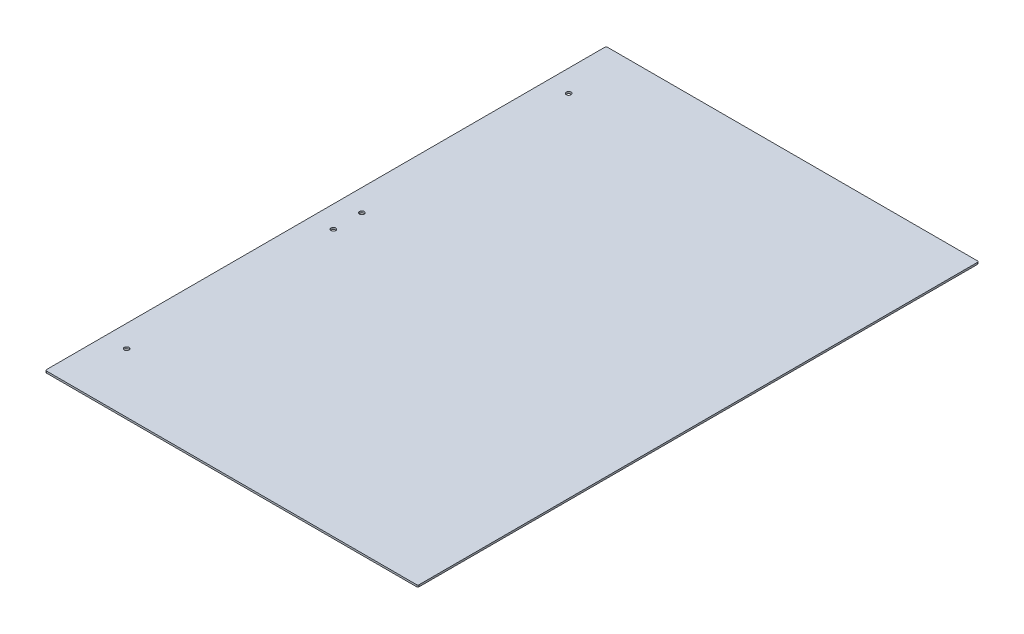
ISO-10303-21;
HEADER;
FILE_DESCRIPTION(('STEP AP214'),'2;1');
FILE_NAME('part.step','',(''),(''),'','','');
FILE_SCHEMA(('AUTOMOTIVE_DESIGN { 1 0 10303 214 1 1 1 1 }'));
ENDSEC;
DATA;
#1=APPLICATION_CONTEXT('core data for automotive mechanical design processes');
#2=APPLICATION_PROTOCOL_DEFINITION('international standard','automotive_design',2000,#1);
#3=PRODUCT_CONTEXT('',#1,'mechanical');
#4=PRODUCT('Part','Part','',(#3));
#5=PRODUCT_RELATED_PRODUCT_CATEGORY('part','',(#4));
#6=PRODUCT_DEFINITION_FORMATION('','',#4);
#7=PRODUCT_DEFINITION_CONTEXT('part definition',#1,'design');
#8=PRODUCT_DEFINITION('design','',#6,#7);
#9=PRODUCT_DEFINITION_SHAPE('','',#8);
#10=(LENGTH_UNIT() NAMED_UNIT(*) SI_UNIT(.MILLI.,.METRE.));
#11=(NAMED_UNIT(*) PLANE_ANGLE_UNIT() SI_UNIT($,.RADIAN.));
#12=(NAMED_UNIT(*) SI_UNIT($,.STERADIAN.) SOLID_ANGLE_UNIT());
#13=UNCERTAINTY_MEASURE_WITH_UNIT(LENGTH_MEASURE(1.E-05),#10,'distance_accuracy_value','');
#14=(GEOMETRIC_REPRESENTATION_CONTEXT(3) GLOBAL_UNCERTAINTY_ASSIGNED_CONTEXT((#13)) GLOBAL_UNIT_ASSIGNED_CONTEXT((#10,
#11,#12)) REPRESENTATION_CONTEXT('',''));
#15=CARTESIAN_POINT('',(0.,0.,0.));
#16=DIRECTION('',(0.,0.,1.));
#17=DIRECTION('',(1.,0.,0.));
#18=AXIS2_PLACEMENT_3D('',#15,#16,#17);
#19=CARTESIAN_POINT('',(0.,3.,0.));
#20=DIRECTION('',(0.,-1.,0.));
#21=DIRECTION('',(0.,0.,-1.));
#22=AXIS2_PLACEMENT_3D('',#19,#20,#21);
#23=PLANE('',#22);
#24=CARTESIAN_POINT('',(-266.065,3.,-23.0886));
#25=DIRECTION('',(0.,1.,0.));
#26=DIRECTION('',(0.,0.,1.));
#27=AXIS2_PLACEMENT_3D('',#24,#25,#26);
#28=CIRCLE('',#27,3.80999999999999);
#29=CARTESIAN_POINT('',(-266.065,3.,-19.2786));
#30=VERTEX_POINT('',#29);
#31=EDGE_CURVE('E143',#30,#30,#28,.F.);
#32=ORIENTED_EDGE('',*,*,#31,.T.);
#33=EDGE_LOOP('',(#32));
#34=FACE_BOUND('',#33,.T.);
#35=CARTESIAN_POINT('',(-299.593,3.,-451.993));
#36=DIRECTION('',(0.,-1.,0.));
#37=DIRECTION('',(0.,0.,-1.));
#38=AXIS2_PLACEMENT_3D('',#35,#36,#37);
#39=CIRCLE('',#38,2.03199999999998);
#40=CARTESIAN_POINT('',(-301.625,3.,-451.993));
#41=VERTEX_POINT('',#40);
#42=CARTESIAN_POINT('',(-299.593,3.,-454.025));
#43=VERTEX_POINT('',#42);
#44=EDGE_CURVE('E80',#41,#43,#39,.T.);
#45=ORIENTED_EDGE('',*,*,#44,.F.);
#46=DIRECTION('',(0.,0.,-1.));
#47=VECTOR('',#46,1.);
#48=CARTESIAN_POINT('',(-301.625,3.,454.025));
#49=LINE('',#48,#47);
#50=CARTESIAN_POINT('',(-301.625,3.,451.993));
#51=VERTEX_POINT('',#50);
#52=EDGE_CURVE('E98',#41,#51,#49,.F.);
#53=ORIENTED_EDGE('',*,*,#52,.T.);
#54=CARTESIAN_POINT('',(-299.593,3.,451.993));
#55=DIRECTION('',(0.,-1.,0.));
#56=DIRECTION('',(0.,0.,-1.));
#57=AXIS2_PLACEMENT_3D('',#54,#55,#56);
#58=CIRCLE('',#57,2.03199999999998);
#59=CARTESIAN_POINT('',(-299.593,3.,454.025));
#60=VERTEX_POINT('',#59);
#61=EDGE_CURVE('E114',#60,#51,#58,.T.);
#62=ORIENTED_EDGE('',*,*,#61,.F.);
#63=DIRECTION('',(-1.,0.,0.));
#64=VECTOR('',#63,1.);
#65=CARTESIAN_POINT('',(-301.625,3.,454.025));
#66=LINE('',#65,#64);
#67=CARTESIAN_POINT('',(299.593,3.,454.025));
#68=VERTEX_POINT('',#67);
#69=EDGE_CURVE('E111',#60,#68,#66,.F.);
#70=ORIENTED_EDGE('',*,*,#69,.T.);
#71=CARTESIAN_POINT('',(299.593,3.,451.993));
#72=DIRECTION('',(0.,-1.,0.));
#73=DIRECTION('',(0.,0.,-1.));
#74=AXIS2_PLACEMENT_3D('',#71,#72,#73);
#75=CIRCLE('',#74,2.03199999999998);
#76=CARTESIAN_POINT('',(301.625,3.,451.993));
#77=VERTEX_POINT('',#76);
#78=EDGE_CURVE('E149',#77,#68,#75,.T.);
#79=ORIENTED_EDGE('',*,*,#78,.F.);
#80=DIRECTION('',(0.,0.,1.));
#81=VECTOR('',#80,1.);
#82=CARTESIAN_POINT('',(301.625,3.,454.025));
#83=LINE('',#82,#81);
#84=CARTESIAN_POINT('',(301.625,3.,-451.993));
#85=VERTEX_POINT('',#84);
#86=EDGE_CURVE('E118',#77,#85,#83,.F.);
#87=ORIENTED_EDGE('',*,*,#86,.T.);
#88=CARTESIAN_POINT('',(299.593,3.,-451.993));
#89=DIRECTION('',(0.,-1.,0.));
#90=DIRECTION('',(0.,0.,-1.));
#91=AXIS2_PLACEMENT_3D('',#88,#89,#90);
#92=CIRCLE('',#91,2.03199999999998);
#93=CARTESIAN_POINT('',(299.593,3.,-454.025));
#94=VERTEX_POINT('',#93);
#95=EDGE_CURVE('E86',#94,#85,#92,.T.);
#96=ORIENTED_EDGE('',*,*,#95,.F.);
#97=DIRECTION('',(1.,0.,0.));
#98=VECTOR('',#97,1.);
#99=CARTESIAN_POINT('',(-301.625,3.,-454.025));
#100=LINE('',#99,#98);
#101=EDGE_CURVE('E83',#94,#43,#100,.F.);
#102=ORIENTED_EDGE('',*,*,#101,.T.);
#103=EDGE_LOOP('',(#45,#53,#62,#70,#79,#87,#96,#102));
#104=FACE_BOUND('',#103,.T.);
#105=CARTESIAN_POINT('',(-266.065,3.,-357.9114));
#106=DIRECTION('',(0.,1.,0.));
#107=DIRECTION('',(0.,0.,1.));
#108=AXIS2_PLACEMENT_3D('',#105,#106,#107);
#109=CIRCLE('',#108,3.80999999999998);
#110=CARTESIAN_POINT('',(-266.065,3.,-354.1014));
#111=VERTEX_POINT('',#110);
#112=EDGE_CURVE('E117',#111,#111,#109,.F.);
#113=ORIENTED_EDGE('',*,*,#112,.T.);
#114=EDGE_LOOP('',(#113));
#115=FACE_BOUND('',#114,.T.);
#116=CARTESIAN_POINT('',(-266.065,3.,23.0886));
#117=DIRECTION('',(0.,1.,0.));
#118=DIRECTION('',(0.,0.,1.));
#119=AXIS2_PLACEMENT_3D('',#116,#117,#118);
#120=CIRCLE('',#119,3.80999999999999);
#121=CARTESIAN_POINT('',(-266.065,3.,26.8986));
#122=VERTEX_POINT('',#121);
#123=EDGE_CURVE('E153',#122,#122,#120,.F.);
#124=ORIENTED_EDGE('',*,*,#123,.T.);
#125=EDGE_LOOP('',(#124));
#126=FACE_BOUND('',#125,.T.);
#127=CARTESIAN_POINT('',(-266.065,3.,357.9114));
#128=DIRECTION('',(0.,1.,0.));
#129=DIRECTION('',(0.,0.,1.));
#130=AXIS2_PLACEMENT_3D('',#127,#128,#129);
#131=CIRCLE('',#130,3.80999999999998);
#132=CARTESIAN_POINT('',(-266.065,3.,361.7214));
#133=VERTEX_POINT('',#132);
#134=EDGE_CURVE('E20',#133,#133,#131,.F.);
#135=ORIENTED_EDGE('',*,*,#134,.T.);
#136=EDGE_LOOP('',(#135));
#137=FACE_BOUND('',#136,.T.);
#138=ADVANCED_FACE('F17',(#34,#104,#115,#126,#137),#23,.F.);
#139=CARTESIAN_POINT('',(-266.065,0.,357.9114));
#140=DIRECTION('',(0.,1.,0.));
#141=DIRECTION('',(0.,0.,1.));
#142=AXIS2_PLACEMENT_3D('',#139,#140,#141);
#143=CYLINDRICAL_SURFACE('',#142,3.80999999999998);
#144=CARTESIAN_POINT('',(-266.065,0.,357.9114));
#145=DIRECTION('',(0.,1.,0.));
#146=DIRECTION('',(0.,0.,1.));
#147=AXIS2_PLACEMENT_3D('',#144,#145,#146);
#148=CIRCLE('',#147,3.80999999999998);
#149=CARTESIAN_POINT('',(-266.065,0.,361.7214));
#150=VERTEX_POINT('',#149);
#151=EDGE_CURVE('E140',#150,#150,#148,.T.);
#152=ORIENTED_EDGE('',*,*,#151,.F.);
#153=EDGE_LOOP('',(#152));
#154=FACE_BOUND('',#153,.T.);
#155=ORIENTED_EDGE('',*,*,#134,.F.);
#156=EDGE_LOOP('',(#155));
#157=FACE_BOUND('',#156,.T.);
#158=ADVANCED_FACE('F161',(#154,#157),#143,.F.);
#159=CARTESIAN_POINT('',(-266.065,0.,23.0886));
#160=DIRECTION('',(0.,1.,0.));
#161=DIRECTION('',(0.,0.,1.));
#162=AXIS2_PLACEMENT_3D('',#159,#160,#161);
#163=CYLINDRICAL_SURFACE('',#162,3.80999999999999);
#164=ORIENTED_EDGE('',*,*,#123,.F.);
#165=EDGE_LOOP('',(#164));
#166=FACE_BOUND('',#165,.T.);
#167=CARTESIAN_POINT('',(-266.065,0.,23.0886));
#168=DIRECTION('',(0.,1.,0.));
#169=DIRECTION('',(0.,0.,1.));
#170=AXIS2_PLACEMENT_3D('',#167,#168,#169);
#171=CIRCLE('',#170,3.80999999999999);
#172=CARTESIAN_POINT('',(-266.065,0.,26.8986));
#173=VERTEX_POINT('',#172);
#174=EDGE_CURVE('E137',#173,#173,#171,.T.);
#175=ORIENTED_EDGE('',*,*,#174,.F.);
#176=EDGE_LOOP('',(#175));
#177=FACE_BOUND('',#176,.T.);
#178=ADVANCED_FACE('F163',(#166,#177),#163,.F.);
#179=CARTESIAN_POINT('',(-266.065,0.,-357.9114));
#180=DIRECTION('',(0.,1.,0.));
#181=DIRECTION('',(0.,0.,1.));
#182=AXIS2_PLACEMENT_3D('',#179,#180,#181);
#183=CYLINDRICAL_SURFACE('',#182,3.80999999999998);
#184=ORIENTED_EDGE('',*,*,#112,.F.);
#185=EDGE_LOOP('',(#184));
#186=FACE_BOUND('',#185,.T.);
#187=CARTESIAN_POINT('',(-266.065,0.,-357.9114));
#188=DIRECTION('',(0.,1.,0.));
#189=DIRECTION('',(0.,0.,1.));
#190=AXIS2_PLACEMENT_3D('',#187,#188,#189);
#191=CIRCLE('',#190,3.80999999999998);
#192=CARTESIAN_POINT('',(-266.065,0.,-354.1014));
#193=VERTEX_POINT('',#192);
#194=EDGE_CURVE('E134',#193,#193,#191,.T.);
#195=ORIENTED_EDGE('',*,*,#194,.F.);
#196=EDGE_LOOP('',(#195));
#197=FACE_BOUND('',#196,.T.);
#198=ADVANCED_FACE('F170',(#186,#197),#183,.F.);
#199=CARTESIAN_POINT('',(-301.625,3.,454.025));
#200=DIRECTION('',(1.,0.,0.));
#201=DIRECTION('',(0.,0.,-1.));
#202=AXIS2_PLACEMENT_3D('',#199,#200,#201);
#203=PLANE('',#202);
#204=DIRECTION('',(0.,-1.,0.));
#205=VECTOR('',#204,1.);
#206=CARTESIAN_POINT('',(-301.625,3.,-451.993));
#207=LINE('',#206,#205);
#208=CARTESIAN_POINT('',(-301.625,0.,-451.993));
#209=VERTEX_POINT('',#208);
#210=EDGE_CURVE('E91',#209,#41,#207,.F.);
#211=ORIENTED_EDGE('',*,*,#210,.F.);
#212=DIRECTION('',(0.,0.,-1.));
#213=VECTOR('',#212,1.);
#214=CARTESIAN_POINT('',(-301.625,0.,0.));
#215=LINE('',#214,#213);
#216=CARTESIAN_POINT('',(-301.625,0.,451.993));
#217=VERTEX_POINT('',#216);
#218=EDGE_CURVE('E133',#217,#209,#215,.T.);
#219=ORIENTED_EDGE('',*,*,#218,.F.);
#220=DIRECTION('',(0.,-1.,0.));
#221=VECTOR('',#220,1.);
#222=CARTESIAN_POINT('',(-301.625,3.,451.993));
#223=LINE('',#222,#221);
#224=EDGE_CURVE('E148',#51,#217,#223,.T.);
#225=ORIENTED_EDGE('',*,*,#224,.F.);
#226=ORIENTED_EDGE('',*,*,#52,.F.);
#227=EDGE_LOOP('',(#211,#219,#225,#226));
#228=FACE_BOUND('',#227,.T.);
#229=ADVANCED_FACE('F210',(#228),#203,.F.);
#230=CARTESIAN_POINT('',(-299.593,3.,-451.993));
#231=DIRECTION('',(0.,-1.,0.));
#232=DIRECTION('',(0.,0.,-1.));
#233=AXIS2_PLACEMENT_3D('',#230,#231,#232);
#234=CYLINDRICAL_SURFACE('',#233,2.03199999999998);
#235=CARTESIAN_POINT('',(-299.593,0.,-451.993));
#236=DIRECTION('',(0.,-1.,0.));
#237=DIRECTION('',(0.,0.,-1.));
#238=AXIS2_PLACEMENT_3D('',#235,#236,#237);
#239=CIRCLE('',#238,2.03199999999998);
#240=CARTESIAN_POINT('',(-299.593,0.,-454.025));
#241=VERTEX_POINT('',#240);
#242=EDGE_CURVE('E131',#209,#241,#239,.T.);
#243=ORIENTED_EDGE('',*,*,#242,.F.);
#244=ORIENTED_EDGE('',*,*,#210,.T.);
#245=ORIENTED_EDGE('',*,*,#44,.T.);
#246=DIRECTION('',(0.,1.,0.));
#247=VECTOR('',#246,1.);
#248=CARTESIAN_POINT('',(-299.593,3.,-454.025));
#249=LINE('',#248,#247);
#250=EDGE_CURVE('E90',#43,#241,#249,.F.);
#251=ORIENTED_EDGE('',*,*,#250,.T.);
#252=EDGE_LOOP('',(#243,#244,#245,#251));
#253=FACE_BOUND('',#252,.T.);
#254=ADVANCED_FACE('F96',(#253),#234,.T.);
#255=CARTESIAN_POINT('',(-301.625,3.,-454.025));
#256=DIRECTION('',(0.,0.,1.));
#257=DIRECTION('',(1.,0.,0.));
#258=AXIS2_PLACEMENT_3D('',#255,#256,#257);
#259=PLANE('',#258);
#260=ORIENTED_EDGE('',*,*,#250,.F.);
#261=ORIENTED_EDGE('',*,*,#101,.F.);
#262=DIRECTION('',(0.,-1.,0.));
#263=VECTOR('',#262,1.);
#264=CARTESIAN_POINT('',(299.593,3.,-454.025));
#265=LINE('',#264,#263);
#266=CARTESIAN_POINT('',(299.593,0.,-454.025));
#267=VERTEX_POINT('',#266);
#268=EDGE_CURVE('E105',#267,#94,#265,.F.);
#269=ORIENTED_EDGE('',*,*,#268,.F.);
#270=DIRECTION('',(1.,0.,0.));
#271=VECTOR('',#270,1.);
#272=CARTESIAN_POINT('',(0.,0.,-454.025));
#273=LINE('',#272,#271);
#274=EDGE_CURVE('E102',#241,#267,#273,.T.);
#275=ORIENTED_EDGE('',*,*,#274,.F.);
#276=EDGE_LOOP('',(#260,#261,#269,#275));
#277=FACE_BOUND('',#276,.T.);
#278=ADVANCED_FACE('F100',(#277),#259,.F.);
#279=CARTESIAN_POINT('',(299.593,3.,-451.993));
#280=DIRECTION('',(0.,-1.,0.));
#281=DIRECTION('',(0.,0.,-1.));
#282=AXIS2_PLACEMENT_3D('',#279,#280,#281);
#283=CYLINDRICAL_SURFACE('',#282,2.03199999999998);
#284=CARTESIAN_POINT('',(299.593,0.,-451.993));
#285=DIRECTION('',(0.,-1.,0.));
#286=DIRECTION('',(0.,0.,-1.));
#287=AXIS2_PLACEMENT_3D('',#284,#285,#286);
#288=CIRCLE('',#287,2.03199999999998);
#289=CARTESIAN_POINT('',(301.625,0.,-451.993));
#290=VERTEX_POINT('',#289);
#291=EDGE_CURVE('E128',#267,#290,#288,.T.);
#292=ORIENTED_EDGE('',*,*,#291,.F.);
#293=ORIENTED_EDGE('',*,*,#268,.T.);
#294=ORIENTED_EDGE('',*,*,#95,.T.);
#295=DIRECTION('',(0.,1.,0.));
#296=VECTOR('',#295,1.);
#297=CARTESIAN_POINT('',(301.625,3.,-451.993));
#298=LINE('',#297,#296);
#299=EDGE_CURVE('E119',#85,#290,#298,.F.);
#300=ORIENTED_EDGE('',*,*,#299,.T.);
#301=EDGE_LOOP('',(#292,#293,#294,#300));
#302=FACE_BOUND('',#301,.T.);
#303=ADVANCED_FACE('F201',(#302),#283,.T.);
#304=CARTESIAN_POINT('',(301.625,3.,454.025));
#305=DIRECTION('',(-1.,0.,0.));
#306=DIRECTION('',(0.,0.,1.));
#307=AXIS2_PLACEMENT_3D('',#304,#305,#306);
#308=PLANE('',#307);
#309=ORIENTED_EDGE('',*,*,#299,.F.);
#310=ORIENTED_EDGE('',*,*,#86,.F.);
#311=DIRECTION('',(0.,-1.,0.));
#312=VECTOR('',#311,1.);
#313=CARTESIAN_POINT('',(301.625,3.,451.993));
#314=LINE('',#313,#312);
#315=CARTESIAN_POINT('',(301.625,0.,451.993));
#316=VERTEX_POINT('',#315);
#317=EDGE_CURVE('E150',#316,#77,#314,.F.);
#318=ORIENTED_EDGE('',*,*,#317,.F.);
#319=DIRECTION('',(0.,0.,-1.));
#320=VECTOR('',#319,1.);
#321=CARTESIAN_POINT('',(301.625,0.,0.));
#322=LINE('',#321,#320);
#323=EDGE_CURVE('E127',#290,#316,#322,.F.);
#324=ORIENTED_EDGE('',*,*,#323,.F.);
#325=EDGE_LOOP('',(#309,#310,#318,#324));
#326=FACE_BOUND('',#325,.T.);
#327=ADVANCED_FACE('F197',(#326),#308,.F.);
#328=CARTESIAN_POINT('',(299.593,3.,451.993));
#329=DIRECTION('',(0.,-1.,0.));
#330=DIRECTION('',(0.,0.,-1.));
#331=AXIS2_PLACEMENT_3D('',#328,#329,#330);
#332=CYLINDRICAL_SURFACE('',#331,2.03199999999998);
#333=CARTESIAN_POINT('',(299.593,0.,451.993));
#334=DIRECTION('',(0.,-1.,0.));
#335=DIRECTION('',(0.,0.,-1.));
#336=AXIS2_PLACEMENT_3D('',#333,#334,#335);
#337=CIRCLE('',#336,2.03199999999998);
#338=CARTESIAN_POINT('',(299.593,0.,454.025));
#339=VERTEX_POINT('',#338);
#340=EDGE_CURVE('E124',#316,#339,#337,.T.);
#341=ORIENTED_EDGE('',*,*,#340,.F.);
#342=ORIENTED_EDGE('',*,*,#317,.T.);
#343=ORIENTED_EDGE('',*,*,#78,.T.);
#344=DIRECTION('',(0.,1.,0.));
#345=VECTOR('',#344,1.);
#346=CARTESIAN_POINT('',(299.593,3.,454.025));
#347=LINE('',#346,#345);
#348=EDGE_CURVE('E115',#68,#339,#347,.F.);
#349=ORIENTED_EDGE('',*,*,#348,.T.);
#350=EDGE_LOOP('',(#341,#342,#343,#349));
#351=FACE_BOUND('',#350,.T.);
#352=ADVANCED_FACE('F194',(#351),#332,.T.);
#353=CARTESIAN_POINT('',(-301.625,3.,454.025));
#354=DIRECTION('',(0.,0.,-1.));
#355=DIRECTION('',(-1.,0.,0.));
#356=AXIS2_PLACEMENT_3D('',#353,#354,#355);
#357=PLANE('',#356);
#358=DIRECTION('',(0.,-1.,0.));
#359=VECTOR('',#358,1.);
#360=CARTESIAN_POINT('',(-299.593,3.,454.025));
#361=LINE('',#360,#359);
#362=CARTESIAN_POINT('',(-299.593,0.,454.025));
#363=VERTEX_POINT('',#362);
#364=EDGE_CURVE('E35',#363,#60,#361,.F.);
#365=ORIENTED_EDGE('',*,*,#364,.F.);
#366=DIRECTION('',(1.,0.,0.));
#367=VECTOR('',#366,1.);
#368=CARTESIAN_POINT('',(0.,0.,454.025));
#369=LINE('',#368,#367);
#370=EDGE_CURVE('E123',#339,#363,#369,.F.);
#371=ORIENTED_EDGE('',*,*,#370,.F.);
#372=ORIENTED_EDGE('',*,*,#348,.F.);
#373=ORIENTED_EDGE('',*,*,#69,.F.);
#374=EDGE_LOOP('',(#365,#371,#372,#373));
#375=FACE_BOUND('',#374,.T.);
#376=ADVANCED_FACE('F190',(#375),#357,.F.);
#377=CARTESIAN_POINT('',(-299.593,3.,451.993));
#378=DIRECTION('',(0.,-1.,0.));
#379=DIRECTION('',(0.,0.,-1.));
#380=AXIS2_PLACEMENT_3D('',#377,#378,#379);
#381=CYLINDRICAL_SURFACE('',#380,2.03199999999998);
#382=CARTESIAN_POINT('',(-299.593,0.,451.993));
#383=DIRECTION('',(0.,-1.,0.));
#384=DIRECTION('',(0.,0.,-1.));
#385=AXIS2_PLACEMENT_3D('',#382,#383,#384);
#386=CIRCLE('',#385,2.03199999999998);
#387=EDGE_CURVE('E26',#363,#217,#386,.T.);
#388=ORIENTED_EDGE('',*,*,#387,.F.);
#389=ORIENTED_EDGE('',*,*,#364,.T.);
#390=ORIENTED_EDGE('',*,*,#61,.T.);
#391=ORIENTED_EDGE('',*,*,#224,.T.);
#392=EDGE_LOOP('',(#388,#389,#390,#391));
#393=FACE_BOUND('',#392,.T.);
#394=ADVANCED_FACE('F183',(#393),#381,.T.);
#395=CARTESIAN_POINT('',(-266.065,0.,-23.0886));
#396=DIRECTION('',(0.,1.,0.));
#397=DIRECTION('',(0.,0.,1.));
#398=AXIS2_PLACEMENT_3D('',#395,#396,#397);
#399=CYLINDRICAL_SURFACE('',#398,3.80999999999999);
#400=CARTESIAN_POINT('',(-266.065,0.,-23.0886));
#401=DIRECTION('',(0.,1.,0.));
#402=DIRECTION('',(0.,0.,1.));
#403=AXIS2_PLACEMENT_3D('',#400,#401,#402);
#404=CIRCLE('',#403,3.80999999999999);
#405=CARTESIAN_POINT('',(-266.065,0.,-19.2786));
#406=VERTEX_POINT('',#405);
#407=EDGE_CURVE('E11',#406,#406,#404,.T.);
#408=ORIENTED_EDGE('',*,*,#407,.F.);
#409=EDGE_LOOP('',(#408));
#410=FACE_BOUND('',#409,.T.);
#411=ORIENTED_EDGE('',*,*,#31,.F.);
#412=EDGE_LOOP('',(#411));
#413=FACE_BOUND('',#412,.T.);
#414=ADVANCED_FACE('F177',(#410,#413),#399,.F.);
#415=CARTESIAN_POINT('',(0.,0.,0.));
#416=DIRECTION('',(0.,-1.,0.));
#417=DIRECTION('',(0.,0.,-1.));
#418=AXIS2_PLACEMENT_3D('',#415,#416,#417);
#419=PLANE('',#418);
#420=ORIENTED_EDGE('',*,*,#407,.T.);
#421=EDGE_LOOP('',(#420));
#422=FACE_BOUND('',#421,.T.);
#423=ORIENTED_EDGE('',*,*,#370,.T.);
#424=ORIENTED_EDGE('',*,*,#387,.T.);
#425=ORIENTED_EDGE('',*,*,#218,.T.);
#426=ORIENTED_EDGE('',*,*,#242,.T.);
#427=ORIENTED_EDGE('',*,*,#274,.T.);
#428=ORIENTED_EDGE('',*,*,#291,.T.);
#429=ORIENTED_EDGE('',*,*,#323,.T.);
#430=ORIENTED_EDGE('',*,*,#340,.T.);
#431=EDGE_LOOP('',(#423,#424,#425,#426,#427,#428,#429,#430));
#432=FACE_BOUND('',#431,.T.);
#433=ORIENTED_EDGE('',*,*,#194,.T.);
#434=EDGE_LOOP('',(#433));
#435=FACE_BOUND('',#434,.T.);
#436=ORIENTED_EDGE('',*,*,#174,.T.);
#437=EDGE_LOOP('',(#436));
#438=FACE_BOUND('',#437,.T.);
#439=ORIENTED_EDGE('',*,*,#151,.T.);
#440=EDGE_LOOP('',(#439));
#441=FACE_BOUND('',#440,.T.);
#442=ADVANCED_FACE('F175',(#422,#432,#435,#438,#441),#419,.T.);
#443=CLOSED_SHELL('',(#138,#158,#178,#198,#229,#254,#278,#303,#327,#352,#376,#394,#414,#442));
#444=MANIFOLD_SOLID_BREP('B1',#443);
#445=ADVANCED_BREP_SHAPE_REPRESENTATION('',(#18,#444),#14);
#446=SHAPE_DEFINITION_REPRESENTATION(#9,#445);
ENDSEC;
END-ISO-10303-21;
